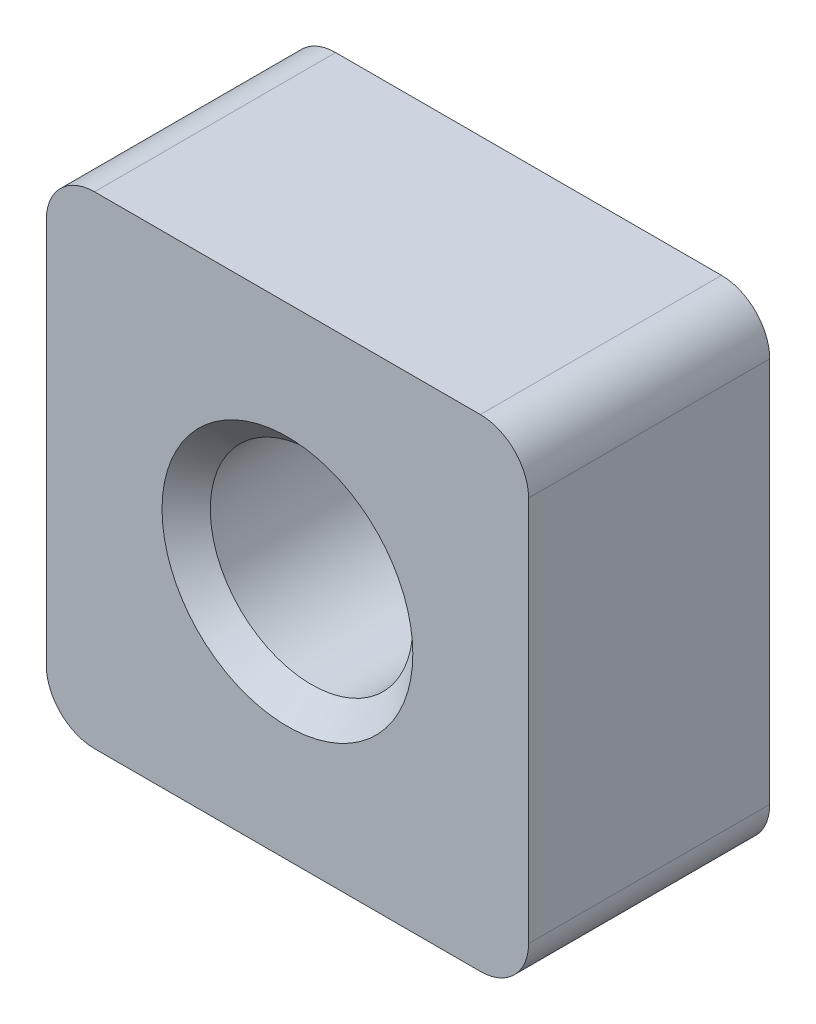
ISO-10303-21;
HEADER;
FILE_DESCRIPTION(('STEP AP214'),'2;1');
FILE_NAME('part.step','',(''),(''),'','','');
FILE_SCHEMA(('AUTOMOTIVE_DESIGN { 1 0 10303 214 1 1 1 1 }'));
ENDSEC;
DATA;
#1=APPLICATION_CONTEXT('core data for automotive mechanical design processes');
#2=APPLICATION_PROTOCOL_DEFINITION('international standard','automotive_design',2000,#1);
#3=PRODUCT_CONTEXT('',#1,'mechanical');
#4=PRODUCT('Part','Part','',(#3));
#5=PRODUCT_RELATED_PRODUCT_CATEGORY('part','',(#4));
#6=PRODUCT_DEFINITION_FORMATION('','',#4);
#7=PRODUCT_DEFINITION_CONTEXT('part definition',#1,'design');
#8=PRODUCT_DEFINITION('design','',#6,#7);
#9=PRODUCT_DEFINITION_SHAPE('','',#8);
#10=(LENGTH_UNIT() NAMED_UNIT(*) SI_UNIT(.MILLI.,.METRE.));
#11=(NAMED_UNIT(*) PLANE_ANGLE_UNIT() SI_UNIT($,.RADIAN.));
#12=(NAMED_UNIT(*) SI_UNIT($,.STERADIAN.) SOLID_ANGLE_UNIT());
#13=UNCERTAINTY_MEASURE_WITH_UNIT(LENGTH_MEASURE(1.E-05),#10,'distance_accuracy_value','');
#14=(GEOMETRIC_REPRESENTATION_CONTEXT(3) GLOBAL_UNCERTAINTY_ASSIGNED_CONTEXT((#13)) GLOBAL_UNIT_ASSIGNED_CONTEXT((#10,
#11,#12)) REPRESENTATION_CONTEXT('',''));
#15=CARTESIAN_POINT('',(0.,0.,0.));
#16=DIRECTION('',(0.,0.,1.));
#17=DIRECTION('',(1.,0.,0.));
#18=AXIS2_PLACEMENT_3D('',#15,#16,#17);
#19=CARTESIAN_POINT('',(5.,-5.,5.));
#20=DIRECTION('',(-1.,0.,0.));
#21=DIRECTION('',(0.,0.,1.));
#22=AXIS2_PLACEMENT_3D('',#19,#20,#21);
#23=PLANE('',#22);
#24=DIRECTION('',(0.,1.,0.));
#25=VECTOR('',#24,1.);
#26=CARTESIAN_POINT('',(5.,-5.,0.));
#27=LINE('',#26,#25);
#28=CARTESIAN_POINT('',(5.,-4.,0.));
#29=VERTEX_POINT('',#28);
#30=CARTESIAN_POINT('',(5.,4.,0.));
#31=VERTEX_POINT('',#30);
#32=EDGE_CURVE('E129',#29,#31,#27,.T.);
#33=ORIENTED_EDGE('',*,*,#32,.T.);
#34=DIRECTION('',(0.,0.,-1.));
#35=VECTOR('',#34,1.);
#36=CARTESIAN_POINT('',(5.,4.,5.));
#37=LINE('',#36,#35);
#38=CARTESIAN_POINT('',(5.,4.,5.));
#39=VERTEX_POINT('',#38);
#40=EDGE_CURVE('E107',#31,#39,#37,.F.);
#41=ORIENTED_EDGE('',*,*,#40,.T.);
#42=DIRECTION('',(0.,1.,0.));
#43=VECTOR('',#42,1.);
#44=CARTESIAN_POINT('',(5.,-5.,5.));
#45=LINE('',#44,#43);
#46=CARTESIAN_POINT('',(5.,-4.,5.));
#47=VERTEX_POINT('',#46);
#48=EDGE_CURVE('E139',#47,#39,#45,.T.);
#49=ORIENTED_EDGE('',*,*,#48,.F.);
#50=DIRECTION('',(0.,0.,-1.));
#51=VECTOR('',#50,1.);
#52=CARTESIAN_POINT('',(5.,-4.,5.));
#53=LINE('',#52,#51);
#54=EDGE_CURVE('E112',#47,#29,#53,.T.);
#55=ORIENTED_EDGE('',*,*,#54,.T.);
#56=EDGE_LOOP('',(#33,#41,#49,#55));
#57=FACE_BOUND('',#56,.T.);
#58=ADVANCED_FACE('F37',(#57),#23,.F.);
#59=CARTESIAN_POINT('',(-5.,5.,5.));
#60=DIRECTION('',(0.,-1.,0.));
#61=DIRECTION('',(0.,0.,-1.));
#62=AXIS2_PLACEMENT_3D('',#59,#60,#61);
#63=PLANE('',#62);
#64=DIRECTION('',(-1.,0.,0.));
#65=VECTOR('',#64,1.);
#66=CARTESIAN_POINT('',(-5.,5.,5.));
#67=LINE('',#66,#65);
#68=CARTESIAN_POINT('',(4.,5.,5.));
#69=VERTEX_POINT('',#68);
#70=CARTESIAN_POINT('',(-4.,5.,5.));
#71=VERTEX_POINT('',#70);
#72=EDGE_CURVE('E122',#69,#71,#67,.T.);
#73=ORIENTED_EDGE('',*,*,#72,.F.);
#74=DIRECTION('',(0.,0.,-1.));
#75=VECTOR('',#74,1.);
#76=CARTESIAN_POINT('',(4.,5.,5.));
#77=LINE('',#76,#75);
#78=CARTESIAN_POINT('',(4.,5.,0.));
#79=VERTEX_POINT('',#78);
#80=EDGE_CURVE('E106',#69,#79,#77,.T.);
#81=ORIENTED_EDGE('',*,*,#80,.T.);
#82=DIRECTION('',(-1.,0.,0.));
#83=VECTOR('',#82,1.);
#84=CARTESIAN_POINT('',(-5.,5.,0.));
#85=LINE('',#84,#83);
#86=CARTESIAN_POINT('',(-4.,5.,0.));
#87=VERTEX_POINT('',#86);
#88=EDGE_CURVE('E119',#79,#87,#85,.T.);
#89=ORIENTED_EDGE('',*,*,#88,.T.);
#90=DIRECTION('',(0.,0.,-1.));
#91=VECTOR('',#90,1.);
#92=CARTESIAN_POINT('',(-4.,5.,5.));
#93=LINE('',#92,#91);
#94=EDGE_CURVE('E124',#87,#71,#93,.F.);
#95=ORIENTED_EDGE('',*,*,#94,.T.);
#96=EDGE_LOOP('',(#73,#81,#89,#95));
#97=FACE_BOUND('',#96,.T.);
#98=ADVANCED_FACE('F118',(#97),#63,.F.);
#99=CARTESIAN_POINT('',(-5.,-5.,5.));
#100=DIRECTION('',(1.,0.,0.));
#101=DIRECTION('',(0.,0.,-1.));
#102=AXIS2_PLACEMENT_3D('',#99,#100,#101);
#103=PLANE('',#102);
#104=DIRECTION('',(0.,-1.,0.));
#105=VECTOR('',#104,1.);
#106=CARTESIAN_POINT('',(-5.,-5.,5.));
#107=LINE('',#106,#105);
#108=CARTESIAN_POINT('',(-5.,4.,5.));
#109=VERTEX_POINT('',#108);
#110=CARTESIAN_POINT('',(-5.,-4.,5.));
#111=VERTEX_POINT('',#110);
#112=EDGE_CURVE('E173',#109,#111,#107,.T.);
#113=ORIENTED_EDGE('',*,*,#112,.F.);
#114=DIRECTION('',(0.,0.,-1.));
#115=VECTOR('',#114,1.);
#116=CARTESIAN_POINT('',(-5.,4.,5.));
#117=LINE('',#116,#115);
#118=CARTESIAN_POINT('',(-5.,4.,0.));
#119=VERTEX_POINT('',#118);
#120=EDGE_CURVE('E158',#109,#119,#117,.T.);
#121=ORIENTED_EDGE('',*,*,#120,.T.);
#122=DIRECTION('',(0.,-1.,0.));
#123=VECTOR('',#122,1.);
#124=CARTESIAN_POINT('',(-5.,-5.,0.));
#125=LINE('',#124,#123);
#126=CARTESIAN_POINT('',(-5.,-4.,0.));
#127=VERTEX_POINT('',#126);
#128=EDGE_CURVE('E128',#119,#127,#125,.T.);
#129=ORIENTED_EDGE('',*,*,#128,.T.);
#130=DIRECTION('',(0.,0.,-1.));
#131=VECTOR('',#130,1.);
#132=CARTESIAN_POINT('',(-5.,-4.,5.));
#133=LINE('',#132,#131);
#134=EDGE_CURVE('E156',#127,#111,#133,.F.);
#135=ORIENTED_EDGE('',*,*,#134,.T.);
#136=EDGE_LOOP('',(#113,#121,#129,#135));
#137=FACE_BOUND('',#136,.T.);
#138=ADVANCED_FACE('F189',(#137),#103,.F.);
#139=CARTESIAN_POINT('',(-5.,-5.,5.));
#140=DIRECTION('',(0.,1.,0.));
#141=DIRECTION('',(0.,0.,1.));
#142=AXIS2_PLACEMENT_3D('',#139,#140,#141);
#143=PLANE('',#142);
#144=DIRECTION('',(1.,0.,0.));
#145=VECTOR('',#144,1.);
#146=CARTESIAN_POINT('',(-5.,-5.,0.));
#147=LINE('',#146,#145);
#148=CARTESIAN_POINT('',(-4.,-5.,0.));
#149=VERTEX_POINT('',#148);
#150=CARTESIAN_POINT('',(4.,-5.,0.));
#151=VERTEX_POINT('',#150);
#152=EDGE_CURVE('E132',#149,#151,#147,.T.);
#153=ORIENTED_EDGE('',*,*,#152,.T.);
#154=DIRECTION('',(0.,0.,-1.));
#155=VECTOR('',#154,1.);
#156=CARTESIAN_POINT('',(4.,-5.,5.));
#157=LINE('',#156,#155);
#158=CARTESIAN_POINT('',(4.,-5.,5.));
#159=VERTEX_POINT('',#158);
#160=EDGE_CURVE('E11',#151,#159,#157,.F.);
#161=ORIENTED_EDGE('',*,*,#160,.T.);
#162=DIRECTION('',(1.,0.,0.));
#163=VECTOR('',#162,1.);
#164=CARTESIAN_POINT('',(-5.,-5.,5.));
#165=LINE('',#164,#163);
#166=CARTESIAN_POINT('',(-4.,-5.,5.));
#167=VERTEX_POINT('',#166);
#168=EDGE_CURVE('E140',#167,#159,#165,.T.);
#169=ORIENTED_EDGE('',*,*,#168,.F.);
#170=DIRECTION('',(0.,0.,-1.));
#171=VECTOR('',#170,1.);
#172=CARTESIAN_POINT('',(-4.,-5.,5.));
#173=LINE('',#172,#171);
#174=EDGE_CURVE('E45',#167,#149,#173,.T.);
#175=ORIENTED_EDGE('',*,*,#174,.T.);
#176=EDGE_LOOP('',(#153,#161,#169,#175));
#177=FACE_BOUND('',#176,.T.);
#178=ADVANCED_FACE('F163',(#177),#143,.F.);
#179=CARTESIAN_POINT('',(0.,0.,5.));
#180=DIRECTION('',(0.,0.,-1.));
#181=DIRECTION('',(-1.,0.,0.));
#182=AXIS2_PLACEMENT_3D('',#179,#180,#181);
#183=PLANE('',#182);
#184=CARTESIAN_POINT('',(0.,0.,5.));
#185=DIRECTION('',(0.,0.,1.));
#186=DIRECTION('',(1.,0.,0.));
#187=AXIS2_PLACEMENT_3D('',#184,#185,#186);
#188=CIRCLE('',#187,2.6);
#189=CARTESIAN_POINT('',(2.6,0.,5.));
#190=VERTEX_POINT('',#189);
#191=EDGE_CURVE('E298',#190,#190,#188,.T.);
#192=ORIENTED_EDGE('',*,*,#191,.F.);
#193=EDGE_LOOP('',(#192));
#194=FACE_BOUND('',#193,.T.);
#195=ORIENTED_EDGE('',*,*,#48,.T.);
#196=CARTESIAN_POINT('',(4.,4.,5.));
#197=DIRECTION('',(0.,0.,-1.));
#198=DIRECTION('',(-1.,0.,0.));
#199=AXIS2_PLACEMENT_3D('',#196,#197,#198);
#200=CIRCLE('',#199,1.);
#201=EDGE_CURVE('E154',#39,#69,#200,.F.);
#202=ORIENTED_EDGE('',*,*,#201,.T.);
#203=ORIENTED_EDGE('',*,*,#72,.T.);
#204=CARTESIAN_POINT('',(-4.,4.,5.));
#205=DIRECTION('',(0.,0.,-1.));
#206=DIRECTION('',(-1.,0.,0.));
#207=AXIS2_PLACEMENT_3D('',#204,#205,#206);
#208=CIRCLE('',#207,1.);
#209=EDGE_CURVE('E152',#71,#109,#208,.F.);
#210=ORIENTED_EDGE('',*,*,#209,.T.);
#211=ORIENTED_EDGE('',*,*,#112,.T.);
#212=CARTESIAN_POINT('',(-4.,-4.,5.));
#213=DIRECTION('',(0.,0.,-1.));
#214=DIRECTION('',(-1.,0.,0.));
#215=AXIS2_PLACEMENT_3D('',#212,#213,#214);
#216=CIRCLE('',#215,1.);
#217=EDGE_CURVE('E57',#111,#167,#216,.F.);
#218=ORIENTED_EDGE('',*,*,#217,.T.);
#219=ORIENTED_EDGE('',*,*,#168,.T.);
#220=CARTESIAN_POINT('',(4.,-4.,5.));
#221=DIRECTION('',(0.,0.,-1.));
#222=DIRECTION('',(-1.,0.,0.));
#223=AXIS2_PLACEMENT_3D('',#220,#221,#222);
#224=CIRCLE('',#223,1.);
#225=EDGE_CURVE('E150',#159,#47,#224,.F.);
#226=ORIENTED_EDGE('',*,*,#225,.T.);
#227=EDGE_LOOP('',(#195,#202,#203,#210,#211,#218,#219,#226));
#228=FACE_BOUND('',#227,.T.);
#229=ADVANCED_FACE('F178',(#194,#228),#183,.F.);
#230=CARTESIAN_POINT('',(0.,0.,0.));
#231=DIRECTION('',(0.,0.,-1.));
#232=DIRECTION('',(-1.,0.,0.));
#233=AXIS2_PLACEMENT_3D('',#230,#231,#232);
#234=PLANE('',#233);
#235=CARTESIAN_POINT('',(0.,0.,0.));
#236=DIRECTION('',(0.,0.,1.));
#237=DIRECTION('',(1.,0.,0.));
#238=AXIS2_PLACEMENT_3D('',#235,#236,#237);
#239=CIRCLE('',#238,2.6);
#240=CARTESIAN_POINT('',(2.6,0.,0.));
#241=VERTEX_POINT('',#240);
#242=EDGE_CURVE('E293',#241,#241,#239,.T.);
#243=ORIENTED_EDGE('',*,*,#242,.T.);
#244=EDGE_LOOP('',(#243));
#245=FACE_BOUND('',#244,.T.);
#246=ORIENTED_EDGE('',*,*,#88,.F.);
#247=CARTESIAN_POINT('',(4.,4.,0.));
#248=DIRECTION('',(0.,0.,-1.));
#249=DIRECTION('',(-1.,0.,0.));
#250=AXIS2_PLACEMENT_3D('',#247,#248,#249);
#251=CIRCLE('',#250,1.);
#252=EDGE_CURVE('E102',#79,#31,#251,.T.);
#253=ORIENTED_EDGE('',*,*,#252,.T.);
#254=ORIENTED_EDGE('',*,*,#32,.F.);
#255=CARTESIAN_POINT('',(4.,-4.,0.));
#256=DIRECTION('',(0.,0.,-1.));
#257=DIRECTION('',(-1.,0.,0.));
#258=AXIS2_PLACEMENT_3D('',#255,#256,#257);
#259=CIRCLE('',#258,1.);
#260=EDGE_CURVE('E143',#29,#151,#259,.T.);
#261=ORIENTED_EDGE('',*,*,#260,.T.);
#262=ORIENTED_EDGE('',*,*,#152,.F.);
#263=CARTESIAN_POINT('',(-4.,-4.,0.));
#264=DIRECTION('',(0.,0.,-1.));
#265=DIRECTION('',(-1.,0.,0.));
#266=AXIS2_PLACEMENT_3D('',#263,#264,#265);
#267=CIRCLE('',#266,1.);
#268=EDGE_CURVE('E123',#149,#127,#267,.T.);
#269=ORIENTED_EDGE('',*,*,#268,.T.);
#270=ORIENTED_EDGE('',*,*,#128,.F.);
#271=CARTESIAN_POINT('',(-4.,4.,0.));
#272=DIRECTION('',(0.,0.,-1.));
#273=DIRECTION('',(-1.,0.,0.));
#274=AXIS2_PLACEMENT_3D('',#271,#272,#273);
#275=CIRCLE('',#274,1.);
#276=EDGE_CURVE('E113',#119,#87,#275,.T.);
#277=ORIENTED_EDGE('',*,*,#276,.T.);
#278=EDGE_LOOP('',(#246,#253,#254,#261,#262,#269,#270,#277));
#279=FACE_BOUND('',#278,.T.);
#280=ADVANCED_FACE('F126',(#245,#279),#234,.T.);
#281=CARTESIAN_POINT('',(0.,0.,0.500000000000001));
#282=DIRECTION('',(0.,0.,-1.));
#283=DIRECTION('',(-1.,0.,0.));
#284=AXIS2_PLACEMENT_3D('',#281,#282,#283);
#285=CONICAL_SURFACE('',#284,2.1,0.785398163397447);
#286=ORIENTED_EDGE('',*,*,#242,.F.);
#287=EDGE_LOOP('',(#286));
#288=FACE_BOUND('',#287,.T.);
#289=CARTESIAN_POINT('',(0.,0.,0.500000000000001));
#290=DIRECTION('',(0.,0.,1.));
#291=DIRECTION('',(1.,0.,0.));
#292=AXIS2_PLACEMENT_3D('',#289,#290,#291);
#293=CIRCLE('',#292,2.1);
#294=CARTESIAN_POINT('',(2.1,0.,0.500000000000001));
#295=VERTEX_POINT('',#294);
#296=EDGE_CURVE('E134',#295,#295,#293,.T.);
#297=ORIENTED_EDGE('',*,*,#296,.T.);
#298=EDGE_LOOP('',(#297));
#299=FACE_BOUND('',#298,.T.);
#300=ADVANCED_FACE('F186',(#288,#299),#285,.F.);
#301=CARTESIAN_POINT('',(0.,0.,5.));
#302=DIRECTION('',(0.,0.,1.));
#303=DIRECTION('',(1.,0.,0.));
#304=AXIS2_PLACEMENT_3D('',#301,#302,#303);
#305=CYLINDRICAL_SURFACE('',#304,2.1);
#306=ORIENTED_EDGE('',*,*,#296,.F.);
#307=EDGE_LOOP('',(#306));
#308=FACE_BOUND('',#307,.T.);
#309=CARTESIAN_POINT('',(0.,0.,4.5));
#310=DIRECTION('',(0.,0.,1.));
#311=DIRECTION('',(1.,0.,0.));
#312=AXIS2_PLACEMENT_3D('',#309,#310,#311);
#313=CIRCLE('',#312,2.1);
#314=CARTESIAN_POINT('',(2.1,0.,4.5));
#315=VERTEX_POINT('',#314);
#316=EDGE_CURVE('E296',#315,#315,#313,.T.);
#317=ORIENTED_EDGE('',*,*,#316,.T.);
#318=EDGE_LOOP('',(#317));
#319=FACE_BOUND('',#318,.T.);
#320=ADVANCED_FACE('F268',(#308,#319),#305,.F.);
#321=CARTESIAN_POINT('',(0.,0.,5.));
#322=DIRECTION('',(0.,0.,1.));
#323=DIRECTION('',(1.,0.,0.));
#324=AXIS2_PLACEMENT_3D('',#321,#322,#323);
#325=CONICAL_SURFACE('',#324,2.6,0.785398163397448);
#326=ORIENTED_EDGE('',*,*,#316,.F.);
#327=EDGE_LOOP('',(#326));
#328=FACE_BOUND('',#327,.T.);
#329=ORIENTED_EDGE('',*,*,#191,.T.);
#330=EDGE_LOOP('',(#329));
#331=FACE_BOUND('',#330,.T.);
#332=ADVANCED_FACE('F204',(#328,#331),#325,.F.);
#333=CARTESIAN_POINT('',(4.,4.,5.));
#334=DIRECTION('',(0.,0.,-1.));
#335=DIRECTION('',(-1.,0.,0.));
#336=AXIS2_PLACEMENT_3D('',#333,#334,#335);
#337=CYLINDRICAL_SURFACE('',#336,1.);
#338=ORIENTED_EDGE('',*,*,#201,.F.);
#339=ORIENTED_EDGE('',*,*,#40,.F.);
#340=ORIENTED_EDGE('',*,*,#252,.F.);
#341=ORIENTED_EDGE('',*,*,#80,.F.);
#342=EDGE_LOOP('',(#338,#339,#340,#341));
#343=FACE_BOUND('',#342,.T.);
#344=ADVANCED_FACE('F105',(#343),#337,.T.);
#345=CARTESIAN_POINT('',(-4.,4.,5.));
#346=DIRECTION('',(0.,0.,-1.));
#347=DIRECTION('',(-1.,0.,0.));
#348=AXIS2_PLACEMENT_3D('',#345,#346,#347);
#349=CYLINDRICAL_SURFACE('',#348,1.);
#350=ORIENTED_EDGE('',*,*,#209,.F.);
#351=ORIENTED_EDGE('',*,*,#94,.F.);
#352=ORIENTED_EDGE('',*,*,#276,.F.);
#353=ORIENTED_EDGE('',*,*,#120,.F.);
#354=EDGE_LOOP('',(#350,#351,#352,#353));
#355=FACE_BOUND('',#354,.T.);
#356=ADVANCED_FACE('F203',(#355),#349,.T.);
#357=CARTESIAN_POINT('',(4.,-4.,5.));
#358=DIRECTION('',(0.,0.,-1.));
#359=DIRECTION('',(-1.,0.,0.));
#360=AXIS2_PLACEMENT_3D('',#357,#358,#359);
#361=CYLINDRICAL_SURFACE('',#360,1.);
#362=ORIENTED_EDGE('',*,*,#225,.F.);
#363=ORIENTED_EDGE('',*,*,#160,.F.);
#364=ORIENTED_EDGE('',*,*,#260,.F.);
#365=ORIENTED_EDGE('',*,*,#54,.F.);
#366=EDGE_LOOP('',(#362,#363,#364,#365));
#367=FACE_BOUND('',#366,.T.);
#368=ADVANCED_FACE('F168',(#367),#361,.T.);
#369=CARTESIAN_POINT('',(-4.,-4.,5.));
#370=DIRECTION('',(0.,0.,-1.));
#371=DIRECTION('',(-1.,0.,0.));
#372=AXIS2_PLACEMENT_3D('',#369,#370,#371);
#373=CYLINDRICAL_SURFACE('',#372,1.);
#374=ORIENTED_EDGE('',*,*,#217,.F.);
#375=ORIENTED_EDGE('',*,*,#134,.F.);
#376=ORIENTED_EDGE('',*,*,#268,.F.);
#377=ORIENTED_EDGE('',*,*,#174,.F.);
#378=EDGE_LOOP('',(#374,#375,#376,#377));
#379=FACE_BOUND('',#378,.T.);
#380=ADVANCED_FACE('F39',(#379),#373,.T.);
#381=CLOSED_SHELL('',(#58,#98,#138,#178,#229,#280,#300,#320,#332,#344,#356,#368,#380));
#382=MANIFOLD_SOLID_BREP('B2',#381);
#383=ADVANCED_BREP_SHAPE_REPRESENTATION('',(#18,#382),#14);
#384=SHAPE_DEFINITION_REPRESENTATION(#9,#383);
ENDSEC;
END-ISO-10303-21;
